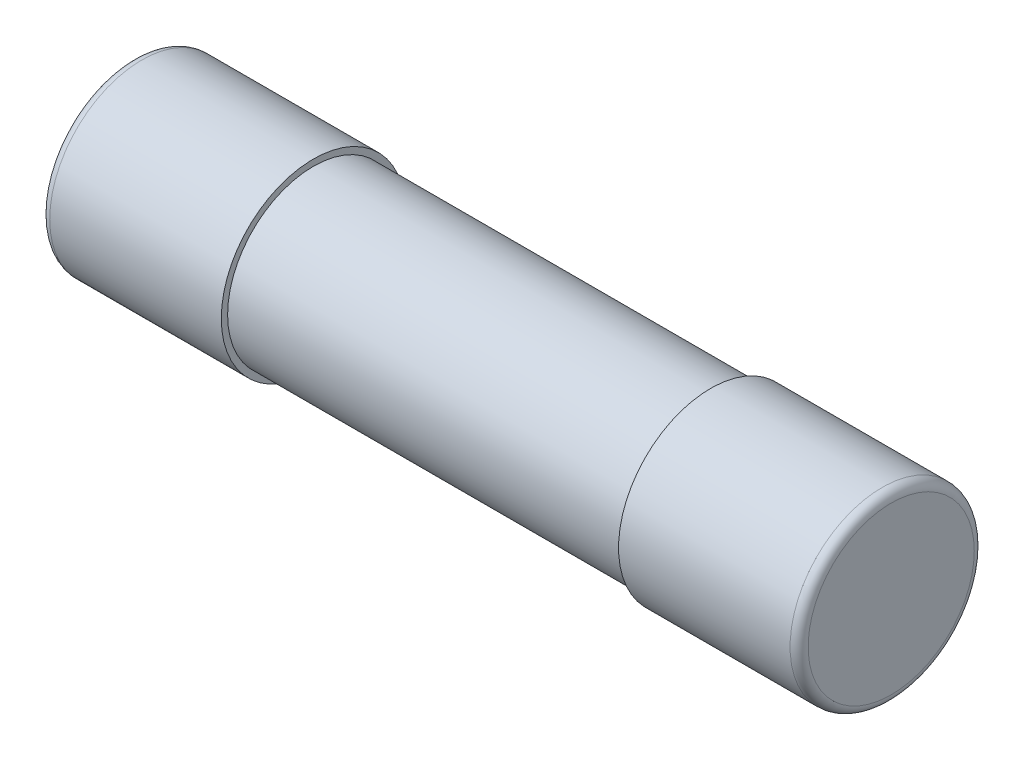
ISO-10303-21;
HEADER;
FILE_DESCRIPTION(('STEP AP214'),'2;1');
FILE_NAME('part.step','',(''),(''),'','','');
FILE_SCHEMA(('AUTOMOTIVE_DESIGN { 1 0 10303 214 1 1 1 1 }'));
ENDSEC;
DATA;
#1=APPLICATION_CONTEXT('core data for automotive mechanical design processes');
#2=APPLICATION_PROTOCOL_DEFINITION('international standard','automotive_design',2000,#1);
#3=PRODUCT_CONTEXT('',#1,'mechanical');
#4=PRODUCT('Part','Part','',(#3));
#5=PRODUCT_RELATED_PRODUCT_CATEGORY('part','',(#4));
#6=PRODUCT_DEFINITION_FORMATION('','',#4);
#7=PRODUCT_DEFINITION_CONTEXT('part definition',#1,'design');
#8=PRODUCT_DEFINITION('design','',#6,#7);
#9=PRODUCT_DEFINITION_SHAPE('','',#8);
#10=(LENGTH_UNIT() NAMED_UNIT(*) SI_UNIT(.MILLI.,.METRE.));
#11=(NAMED_UNIT(*) PLANE_ANGLE_UNIT() SI_UNIT($,.RADIAN.));
#12=(NAMED_UNIT(*) SI_UNIT($,.STERADIAN.) SOLID_ANGLE_UNIT());
#13=UNCERTAINTY_MEASURE_WITH_UNIT(LENGTH_MEASURE(1.E-05),#10,'distance_accuracy_value','');
#14=(GEOMETRIC_REPRESENTATION_CONTEXT(3) GLOBAL_UNCERTAINTY_ASSIGNED_CONTEXT((#13)) GLOBAL_UNIT_ASSIGNED_CONTEXT((#10,
#11,#12)) REPRESENTATION_CONTEXT('',''));
#15=CARTESIAN_POINT('',(0.,0.,0.));
#16=DIRECTION('',(0.,0.,1.));
#17=DIRECTION('',(1.,0.,0.));
#18=AXIS2_PLACEMENT_3D('',#15,#16,#17);
#19=CARTESIAN_POINT('',(10.,0.,0.));
#20=DIRECTION('',(-1.,0.,0.));
#21=DIRECTION('',(0.,0.,1.));
#22=AXIS2_PLACEMENT_3D('',#19,#20,#21);
#23=CYLINDRICAL_SURFACE('',#22,2.375);
#24=CARTESIAN_POINT('',(5.5,0.,0.));
#25=DIRECTION('',(1.,0.,0.));
#26=DIRECTION('',(0.,0.,-1.));
#27=AXIS2_PLACEMENT_3D('',#24,#25,#26);
#28=CIRCLE('',#27,2.375);
#29=CARTESIAN_POINT('',(5.5,0.,-2.375));
#30=VERTEX_POINT('',#29);
#31=EDGE_CURVE('E65',#30,#30,#28,.T.);
#32=ORIENTED_EDGE('',*,*,#31,.F.);
#33=EDGE_LOOP('',(#32));
#34=FACE_BOUND('',#33,.T.);
#35=CARTESIAN_POINT('',(-5.5,0.,0.));
#36=DIRECTION('',(-1.,0.,0.));
#37=DIRECTION('',(0.,0.,1.));
#38=AXIS2_PLACEMENT_3D('',#35,#36,#37);
#39=CIRCLE('',#38,2.375);
#40=CARTESIAN_POINT('',(-5.5,0.,2.375));
#41=VERTEX_POINT('',#40);
#42=EDGE_CURVE('E48',#41,#41,#39,.T.);
#43=ORIENTED_EDGE('',*,*,#42,.F.);
#44=EDGE_LOOP('',(#43));
#45=FACE_BOUND('',#44,.T.);
#46=ADVANCED_FACE('F36',(#34,#45),#23,.T.);
#47=CARTESIAN_POINT('',(5.5,0.,0.));
#48=DIRECTION('',(1.,0.,0.));
#49=DIRECTION('',(0.,0.,-1.));
#50=AXIS2_PLACEMENT_3D('',#47,#48,#49);
#51=PLANE('',#50);
#52=CARTESIAN_POINT('',(5.5,0.,0.));
#53=DIRECTION('',(1.,0.,0.));
#54=DIRECTION('',(0.,0.,-1.));
#55=AXIS2_PLACEMENT_3D('',#52,#53,#54);
#56=CIRCLE('',#55,2.55);
#57=CARTESIAN_POINT('',(5.5,0.,-2.55));
#58=VERTEX_POINT('',#57);
#59=EDGE_CURVE('E69',#58,#58,#56,.T.);
#60=ORIENTED_EDGE('',*,*,#59,.F.);
#61=EDGE_LOOP('',(#60));
#62=FACE_BOUND('',#61,.T.);
#63=ORIENTED_EDGE('',*,*,#31,.T.);
#64=EDGE_LOOP('',(#63));
#65=FACE_BOUND('',#64,.T.);
#66=ADVANCED_FACE('F93',(#62,#65),#51,.F.);
#67=CARTESIAN_POINT('',(5.5,0.,0.));
#68=DIRECTION('',(1.,0.,0.));
#69=DIRECTION('',(0.,0.,-1.));
#70=AXIS2_PLACEMENT_3D('',#67,#68,#69);
#71=CYLINDRICAL_SURFACE('',#70,2.55);
#72=CARTESIAN_POINT('',(10.25,0.,0.));
#73=DIRECTION('',(1.,0.,0.));
#74=DIRECTION('',(0.,0.,-1.));
#75=AXIS2_PLACEMENT_3D('',#72,#73,#74);
#76=CIRCLE('',#75,2.55);
#77=CARTESIAN_POINT('',(10.25,0.,-2.55));
#78=VERTEX_POINT('',#77);
#79=EDGE_CURVE('E52',#78,#78,#76,.F.);
#80=ORIENTED_EDGE('',*,*,#79,.T.);
#81=EDGE_LOOP('',(#80));
#82=FACE_BOUND('',#81,.T.);
#83=ORIENTED_EDGE('',*,*,#59,.T.);
#84=EDGE_LOOP('',(#83));
#85=FACE_BOUND('',#84,.T.);
#86=ADVANCED_FACE('F99',(#82,#85),#71,.T.);
#87=CARTESIAN_POINT('',(10.5,0.,0.));
#88=DIRECTION('',(1.,0.,0.));
#89=DIRECTION('',(0.,0.,-1.));
#90=AXIS2_PLACEMENT_3D('',#87,#88,#89);
#91=PLANE('',#90);
#92=CARTESIAN_POINT('',(10.5,0.,0.));
#93=DIRECTION('',(1.,0.,0.));
#94=DIRECTION('',(0.,0.,-1.));
#95=AXIS2_PLACEMENT_3D('',#92,#93,#94);
#96=CIRCLE('',#95,2.3);
#97=CARTESIAN_POINT('',(10.5,0.,-2.3));
#98=VERTEX_POINT('',#97);
#99=EDGE_CURVE('E62',#98,#98,#96,.T.);
#100=ORIENTED_EDGE('',*,*,#99,.T.);
#101=EDGE_LOOP('',(#100));
#102=FACE_BOUND('',#101,.T.);
#103=ADVANCED_FACE('F108',(#102),#91,.T.);
#104=CARTESIAN_POINT('',(10.25,0.,0.));
#105=DIRECTION('',(1.,0.,0.));
#106=DIRECTION('',(0.,0.,-1.));
#107=AXIS2_PLACEMENT_3D('',#104,#105,#106);
#108=TOROIDAL_SURFACE('',#107,2.3,0.25);
#109=ORIENTED_EDGE('',*,*,#79,.F.);
#110=EDGE_LOOP('',(#109));
#111=FACE_BOUND('',#110,.T.);
#112=ORIENTED_EDGE('',*,*,#99,.F.);
#113=EDGE_LOOP('',(#112));
#114=FACE_BOUND('',#113,.T.);
#115=ADVANCED_FACE('F87',(#111,#114),#108,.T.);
#116=CARTESIAN_POINT('',(-5.5,0.,0.));
#117=DIRECTION('',(-1.,0.,0.));
#118=DIRECTION('',(0.,0.,1.));
#119=AXIS2_PLACEMENT_3D('',#116,#117,#118);
#120=PLANE('',#119);
#121=CARTESIAN_POINT('',(-5.5,0.,0.));
#122=DIRECTION('',(-1.,0.,0.));
#123=DIRECTION('',(0.,0.,1.));
#124=AXIS2_PLACEMENT_3D('',#121,#122,#123);
#125=CIRCLE('',#124,2.55);
#126=CARTESIAN_POINT('',(-5.5,0.,2.55));
#127=VERTEX_POINT('',#126);
#128=EDGE_CURVE('E59',#127,#127,#125,.T.);
#129=ORIENTED_EDGE('',*,*,#128,.F.);
#130=EDGE_LOOP('',(#129));
#131=FACE_BOUND('',#130,.T.);
#132=ORIENTED_EDGE('',*,*,#42,.T.);
#133=EDGE_LOOP('',(#132));
#134=FACE_BOUND('',#133,.T.);
#135=ADVANCED_FACE('F84',(#131,#134),#120,.F.);
#136=CARTESIAN_POINT('',(-5.5,0.,0.));
#137=DIRECTION('',(-1.,0.,0.));
#138=DIRECTION('',(0.,0.,1.));
#139=AXIS2_PLACEMENT_3D('',#136,#137,#138);
#140=CYLINDRICAL_SURFACE('',#139,2.55);
#141=CARTESIAN_POINT('',(-10.25,0.,0.));
#142=DIRECTION('',(-1.,0.,0.));
#143=DIRECTION('',(0.,0.,1.));
#144=AXIS2_PLACEMENT_3D('',#141,#142,#143);
#145=CIRCLE('',#144,2.55);
#146=CARTESIAN_POINT('',(-10.25,0.,2.55));
#147=VERTEX_POINT('',#146);
#148=EDGE_CURVE('E10',#147,#147,#145,.F.);
#149=ORIENTED_EDGE('',*,*,#148,.T.);
#150=EDGE_LOOP('',(#149));
#151=FACE_BOUND('',#150,.T.);
#152=ORIENTED_EDGE('',*,*,#128,.T.);
#153=EDGE_LOOP('',(#152));
#154=FACE_BOUND('',#153,.T.);
#155=ADVANCED_FACE('F82',(#151,#154),#140,.T.);
#156=CARTESIAN_POINT('',(-10.5,0.,0.));
#157=DIRECTION('',(-1.,0.,0.));
#158=DIRECTION('',(0.,0.,1.));
#159=AXIS2_PLACEMENT_3D('',#156,#157,#158);
#160=PLANE('',#159);
#161=CARTESIAN_POINT('',(-10.5,0.,0.));
#162=DIRECTION('',(-1.,0.,0.));
#163=DIRECTION('',(0.,0.,1.));
#164=AXIS2_PLACEMENT_3D('',#161,#162,#163);
#165=CIRCLE('',#164,2.3);
#166=CARTESIAN_POINT('',(-10.5,0.,2.3));
#167=VERTEX_POINT('',#166);
#168=EDGE_CURVE('E44',#167,#167,#165,.T.);
#169=ORIENTED_EDGE('',*,*,#168,.T.);
#170=EDGE_LOOP('',(#169));
#171=FACE_BOUND('',#170,.T.);
#172=ADVANCED_FACE('F135',(#171),#160,.T.);
#173=CARTESIAN_POINT('',(-10.25,0.,0.));
#174=DIRECTION('',(-1.,0.,0.));
#175=DIRECTION('',(0.,0.,1.));
#176=AXIS2_PLACEMENT_3D('',#173,#174,#175);
#177=TOROIDAL_SURFACE('',#176,2.3,0.25);
#178=ORIENTED_EDGE('',*,*,#148,.F.);
#179=EDGE_LOOP('',(#178));
#180=FACE_BOUND('',#179,.T.);
#181=ORIENTED_EDGE('',*,*,#168,.F.);
#182=EDGE_LOOP('',(#181));
#183=FACE_BOUND('',#182,.T.);
#184=ADVANCED_FACE('F38',(#180,#183),#177,.T.);
#185=CLOSED_SHELL('',(#46,#66,#86,#103,#115,#135,#155,#172,#184));
#186=CARTESIAN_POINT('',(10.,0.,0.));
#187=DIRECTION('',(-1.,0.,0.));
#188=DIRECTION('',(0.,0.,1.));
#189=AXIS2_PLACEMENT_3D('',#186,#187,#188);
#190=CYLINDRICAL_SURFACE('',#189,2.175);
#191=CARTESIAN_POINT('',(5.5,0.,0.));
#192=DIRECTION('',(1.,0.,0.));
#193=DIRECTION('',(0.,0.,-1.));
#194=AXIS2_PLACEMENT_3D('',#191,#192,#193);
#195=CIRCLE('',#194,2.175);
#196=CARTESIAN_POINT('',(5.5,0.,-2.175));
#197=VERTEX_POINT('',#196);
#198=EDGE_CURVE('E70',#197,#197,#195,.T.);
#199=ORIENTED_EDGE('',*,*,#198,.T.);
#200=EDGE_LOOP('',(#199));
#201=FACE_BOUND('',#200,.T.);
#202=CARTESIAN_POINT('',(-5.5,0.,0.));
#203=DIRECTION('',(-1.,0.,0.));
#204=DIRECTION('',(0.,0.,1.));
#205=AXIS2_PLACEMENT_3D('',#202,#203,#204);
#206=CIRCLE('',#205,2.175);
#207=CARTESIAN_POINT('',(-5.5,0.,2.175));
#208=VERTEX_POINT('',#207);
#209=EDGE_CURVE('E58',#208,#208,#206,.T.);
#210=ORIENTED_EDGE('',*,*,#209,.T.);
#211=EDGE_LOOP('',(#210));
#212=FACE_BOUND('',#211,.T.);
#213=ADVANCED_FACE('F105',(#201,#212),#190,.F.);
#214=CARTESIAN_POINT('',(5.5,0.,0.));
#215=DIRECTION('',(1.,0.,0.));
#216=DIRECTION('',(0.,0.,-1.));
#217=AXIS2_PLACEMENT_3D('',#214,#215,#216);
#218=CIRCLE('',#217,0.05);
#219=CARTESIAN_POINT('',(5.5,0.,-0.05));
#220=VERTEX_POINT('',#219);
#221=EDGE_CURVE('E66',#220,#220,#218,.T.);
#222=ORIENTED_EDGE('',*,*,#221,.T.);
#223=EDGE_LOOP('',(#222));
#224=FACE_BOUND('',#223,.T.);
#225=ORIENTED_EDGE('',*,*,#198,.F.);
#226=EDGE_LOOP('',(#225));
#227=FACE_BOUND('',#226,.T.);
#228=ADVANCED_FACE('F102',(#224,#227),#51,.F.);
#229=CARTESIAN_POINT('',(-9.65,0.,0.));
#230=DIRECTION('',(1.,0.,0.));
#231=DIRECTION('',(0.,0.,-1.));
#232=AXIS2_PLACEMENT_3D('',#229,#230,#231);
#233=CYLINDRICAL_SURFACE('',#232,0.05);
#234=ORIENTED_EDGE('',*,*,#221,.F.);
#235=EDGE_LOOP('',(#234));
#236=FACE_BOUND('',#235,.T.);
#237=CARTESIAN_POINT('',(-5.5,0.,0.));
#238=DIRECTION('',(-1.,0.,0.));
#239=DIRECTION('',(0.,0.,1.));
#240=AXIS2_PLACEMENT_3D('',#237,#238,#239);
#241=CIRCLE('',#240,0.05);
#242=CARTESIAN_POINT('',(-5.5,0.,0.05));
#243=VERTEX_POINT('',#242);
#244=EDGE_CURVE('E55',#243,#243,#241,.F.);
#245=ORIENTED_EDGE('',*,*,#244,.T.);
#246=EDGE_LOOP('',(#245));
#247=FACE_BOUND('',#246,.T.);
#248=ADVANCED_FACE('F127',(#236,#247),#233,.T.);
#249=ORIENTED_EDGE('',*,*,#209,.F.);
#250=EDGE_LOOP('',(#249));
#251=FACE_BOUND('',#250,.T.);
#252=ORIENTED_EDGE('',*,*,#244,.F.);
#253=EDGE_LOOP('',(#252));
#254=FACE_BOUND('',#253,.T.);
#255=ADVANCED_FACE('F89',(#251,#254),#120,.F.);
#256=CLOSED_SHELL('',(#213,#228,#248,#255));
#257=ORIENTED_CLOSED_SHELL('',*,#256,.T.);
#258=BREP_WITH_VOIDS('B2',#185,(#257));
#259=ADVANCED_BREP_SHAPE_REPRESENTATION('',(#18,#258),#14);
#260=SHAPE_DEFINITION_REPRESENTATION(#9,#259);
ENDSEC;
END-ISO-10303-21;
